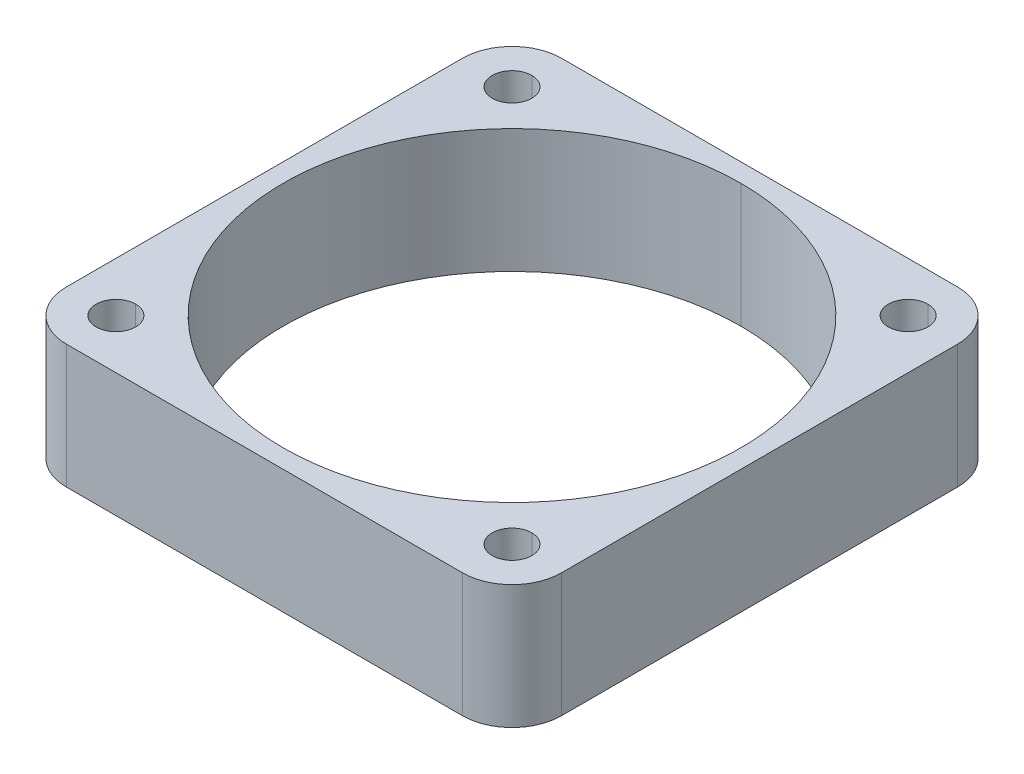
ISO-10303-21;
HEADER;
FILE_DESCRIPTION(('STEP AP214'),'2;1');
FILE_NAME('part.step','',(''),(''),'','','');
FILE_SCHEMA(('AUTOMOTIVE_DESIGN { 1 0 10303 214 1 1 1 1 }'));
ENDSEC;
DATA;
#1=APPLICATION_CONTEXT('core data for automotive mechanical design processes');
#2=APPLICATION_PROTOCOL_DEFINITION('international standard','automotive_design',2000,#1);
#3=PRODUCT_CONTEXT('',#1,'mechanical');
#4=PRODUCT('Part','Part','',(#3));
#5=PRODUCT_RELATED_PRODUCT_CATEGORY('part','',(#4));
#6=PRODUCT_DEFINITION_FORMATION('','',#4);
#7=PRODUCT_DEFINITION_CONTEXT('part definition',#1,'design');
#8=PRODUCT_DEFINITION('design','',#6,#7);
#9=PRODUCT_DEFINITION_SHAPE('','',#8);
#10=(LENGTH_UNIT() NAMED_UNIT(*) SI_UNIT(.MILLI.,.METRE.));
#11=(NAMED_UNIT(*) PLANE_ANGLE_UNIT() SI_UNIT($,.RADIAN.));
#12=(NAMED_UNIT(*) SI_UNIT($,.STERADIAN.) SOLID_ANGLE_UNIT());
#13=UNCERTAINTY_MEASURE_WITH_UNIT(LENGTH_MEASURE(1.E-05),#10,'distance_accuracy_value','');
#14=(GEOMETRIC_REPRESENTATION_CONTEXT(3) GLOBAL_UNCERTAINTY_ASSIGNED_CONTEXT((#13)) GLOBAL_UNIT_ASSIGNED_CONTEXT((#10,
#11,#12)) REPRESENTATION_CONTEXT('',''));
#15=CARTESIAN_POINT('',(0.,0.,0.));
#16=DIRECTION('',(0.,0.,1.));
#17=DIRECTION('',(1.,0.,0.));
#18=AXIS2_PLACEMENT_3D('',#15,#16,#17);
#19=CARTESIAN_POINT('',(16.,5.,16.));
#20=DIRECTION('',(0.,-1.,0.));
#21=DIRECTION('',(0.,0.,-1.));
#22=AXIS2_PLACEMENT_3D('',#19,#20,#21);
#23=CYLINDRICAL_SURFACE('',#22,1.6);
#24=CARTESIAN_POINT('',(16.,5.,16.));
#25=DIRECTION('',(0.,1.,0.));
#26=DIRECTION('',(0.,0.,1.));
#27=AXIS2_PLACEMENT_3D('',#24,#25,#26);
#28=CIRCLE('',#27,1.6);
#29=CARTESIAN_POINT('',(16.,5.,17.6));
#30=VERTEX_POINT('',#29);
#31=CARTESIAN_POINT('',(16.,5.,14.4));
#32=VERTEX_POINT('',#31);
#33=EDGE_CURVE('E268',#30,#32,#28,.T.);
#34=ORIENTED_EDGE('',*,*,#33,.T.);
#35=DIRECTION('',(0.,-1.,0.));
#36=VECTOR('',#35,1.);
#37=CARTESIAN_POINT('',(16.,5.,14.4));
#38=LINE('',#37,#36);
#39=CARTESIAN_POINT('',(16.,-5.,14.4));
#40=VERTEX_POINT('',#39);
#41=EDGE_CURVE('E11',#32,#40,#38,.T.);
#42=ORIENTED_EDGE('',*,*,#41,.T.);
#43=CARTESIAN_POINT('',(16.,-5.,16.));
#44=DIRECTION('',(0.,-1.,0.));
#45=DIRECTION('',(0.,0.,-1.));
#46=AXIS2_PLACEMENT_3D('',#43,#44,#45);
#47=CIRCLE('',#46,1.6);
#48=CARTESIAN_POINT('',(16.,-5.,17.6));
#49=VERTEX_POINT('',#48);
#50=EDGE_CURVE('E207',#40,#49,#47,.T.);
#51=ORIENTED_EDGE('',*,*,#50,.T.);
#52=DIRECTION('',(0.,-1.,0.));
#53=VECTOR('',#52,1.);
#54=CARTESIAN_POINT('',(16.,5.,17.6));
#55=LINE('',#54,#53);
#56=EDGE_CURVE('E27',#30,#49,#55,.T.);
#57=ORIENTED_EDGE('',*,*,#56,.F.);
#58=EDGE_LOOP('',(#34,#42,#51,#57));
#59=FACE_BOUND('',#58,.T.);
#60=ADVANCED_FACE('F16',(#59),#23,.F.);
#61=CARTESIAN_POINT('',(16.,5.,16.));
#62=DIRECTION('',(0.,-1.,0.));
#63=DIRECTION('',(0.,0.,-1.));
#64=AXIS2_PLACEMENT_3D('',#61,#62,#63);
#65=CYLINDRICAL_SURFACE('',#64,1.6);
#66=ORIENTED_EDGE('',*,*,#56,.T.);
#67=CARTESIAN_POINT('',(16.,-5.,16.));
#68=DIRECTION('',(0.,-1.,0.));
#69=DIRECTION('',(0.,0.,1.));
#70=AXIS2_PLACEMENT_3D('',#67,#68,#69);
#71=CIRCLE('',#70,1.6);
#72=EDGE_CURVE('E241',#49,#40,#71,.T.);
#73=ORIENTED_EDGE('',*,*,#72,.T.);
#74=ORIENTED_EDGE('',*,*,#41,.F.);
#75=CARTESIAN_POINT('',(16.,5.,16.));
#76=DIRECTION('',(0.,1.,0.));
#77=DIRECTION('',(0.,0.,-1.));
#78=AXIS2_PLACEMENT_3D('',#75,#76,#77);
#79=CIRCLE('',#78,1.6);
#80=EDGE_CURVE('E228',#32,#30,#79,.T.);
#81=ORIENTED_EDGE('',*,*,#80,.T.);
#82=EDGE_LOOP('',(#66,#73,#74,#81));
#83=FACE_BOUND('',#82,.T.);
#84=ADVANCED_FACE('F432',(#83),#65,.F.);
#85=CARTESIAN_POINT('',(-16.,5.,16.));
#86=DIRECTION('',(0.,-1.,0.));
#87=DIRECTION('',(0.,0.,-1.));
#88=AXIS2_PLACEMENT_3D('',#85,#86,#87);
#89=CYLINDRICAL_SURFACE('',#88,1.6);
#90=CARTESIAN_POINT('',(-16.,5.,16.));
#91=DIRECTION('',(0.,1.,0.));
#92=DIRECTION('',(0.,0.,1.));
#93=AXIS2_PLACEMENT_3D('',#90,#91,#92);
#94=CIRCLE('',#93,1.6);
#95=CARTESIAN_POINT('',(-16.,5.,17.6));
#96=VERTEX_POINT('',#95);
#97=CARTESIAN_POINT('',(-16.,5.,14.4));
#98=VERTEX_POINT('',#97);
#99=EDGE_CURVE('E277',#96,#98,#94,.T.);
#100=ORIENTED_EDGE('',*,*,#99,.T.);
#101=DIRECTION('',(0.,-1.,0.));
#102=VECTOR('',#101,1.);
#103=CARTESIAN_POINT('',(-16.,5.,14.4));
#104=LINE('',#103,#102);
#105=CARTESIAN_POINT('',(-16.,-5.,14.4));
#106=VERTEX_POINT('',#105);
#107=EDGE_CURVE('E200',#98,#106,#104,.T.);
#108=ORIENTED_EDGE('',*,*,#107,.T.);
#109=CARTESIAN_POINT('',(-16.,-5.,16.));
#110=DIRECTION('',(0.,-1.,0.));
#111=DIRECTION('',(0.,0.,-1.));
#112=AXIS2_PLACEMENT_3D('',#109,#110,#111);
#113=CIRCLE('',#112,1.6);
#114=CARTESIAN_POINT('',(-16.,-5.,17.6));
#115=VERTEX_POINT('',#114);
#116=EDGE_CURVE('E20',#106,#115,#113,.T.);
#117=ORIENTED_EDGE('',*,*,#116,.T.);
#118=DIRECTION('',(0.,-1.,0.));
#119=VECTOR('',#118,1.);
#120=CARTESIAN_POINT('',(-16.,5.,17.6));
#121=LINE('',#120,#119);
#122=EDGE_CURVE('E189',#96,#115,#121,.T.);
#123=ORIENTED_EDGE('',*,*,#122,.F.);
#124=EDGE_LOOP('',(#100,#108,#117,#123));
#125=FACE_BOUND('',#124,.T.);
#126=ADVANCED_FACE('F209',(#125),#89,.F.);
#127=CARTESIAN_POINT('',(-16.,5.,16.));
#128=DIRECTION('',(0.,-1.,0.));
#129=DIRECTION('',(0.,0.,-1.));
#130=AXIS2_PLACEMENT_3D('',#127,#128,#129);
#131=CYLINDRICAL_SURFACE('',#130,1.6);
#132=ORIENTED_EDGE('',*,*,#122,.T.);
#133=CARTESIAN_POINT('',(-16.,-5.,16.));
#134=DIRECTION('',(0.,-1.,0.));
#135=DIRECTION('',(0.,0.,1.));
#136=AXIS2_PLACEMENT_3D('',#133,#134,#135);
#137=CIRCLE('',#136,1.6);
#138=EDGE_CURVE('E191',#115,#106,#137,.T.);
#139=ORIENTED_EDGE('',*,*,#138,.T.);
#140=ORIENTED_EDGE('',*,*,#107,.F.);
#141=CARTESIAN_POINT('',(-16.,5.,16.));
#142=DIRECTION('',(0.,1.,0.));
#143=DIRECTION('',(0.,0.,-1.));
#144=AXIS2_PLACEMENT_3D('',#141,#142,#143);
#145=CIRCLE('',#144,1.6);
#146=EDGE_CURVE('E194',#98,#96,#145,.T.);
#147=ORIENTED_EDGE('',*,*,#146,.T.);
#148=EDGE_LOOP('',(#132,#139,#140,#147));
#149=FACE_BOUND('',#148,.T.);
#150=ADVANCED_FACE('F18',(#149),#131,.F.);
#151=CARTESIAN_POINT('',(-16.,5.,-16.));
#152=DIRECTION('',(0.,-1.,0.));
#153=DIRECTION('',(0.,0.,-1.));
#154=AXIS2_PLACEMENT_3D('',#151,#152,#153);
#155=CYLINDRICAL_SURFACE('',#154,1.6);
#156=CARTESIAN_POINT('',(-16.,5.,-16.));
#157=DIRECTION('',(0.,1.,0.));
#158=DIRECTION('',(0.,0.,1.));
#159=AXIS2_PLACEMENT_3D('',#156,#157,#158);
#160=CIRCLE('',#159,1.6);
#161=CARTESIAN_POINT('',(-16.,5.,-14.4));
#162=VERTEX_POINT('',#161);
#163=CARTESIAN_POINT('',(-16.,5.,-17.6));
#164=VERTEX_POINT('',#163);
#165=EDGE_CURVE('E314',#162,#164,#160,.T.);
#166=ORIENTED_EDGE('',*,*,#165,.T.);
#167=DIRECTION('',(0.,-1.,0.));
#168=VECTOR('',#167,1.);
#169=CARTESIAN_POINT('',(-16.,5.,-17.6));
#170=LINE('',#169,#168);
#171=CARTESIAN_POINT('',(-16.,-5.,-17.6));
#172=VERTEX_POINT('',#171);
#173=EDGE_CURVE('E201',#164,#172,#170,.T.);
#174=ORIENTED_EDGE('',*,*,#173,.T.);
#175=CARTESIAN_POINT('',(-16.,-5.,-16.));
#176=DIRECTION('',(0.,-1.,0.));
#177=DIRECTION('',(0.,0.,-1.));
#178=AXIS2_PLACEMENT_3D('',#175,#176,#177);
#179=CIRCLE('',#178,1.6);
#180=CARTESIAN_POINT('',(-16.,-5.,-14.4));
#181=VERTEX_POINT('',#180);
#182=EDGE_CURVE('E217',#172,#181,#179,.T.);
#183=ORIENTED_EDGE('',*,*,#182,.T.);
#184=DIRECTION('',(0.,-1.,0.));
#185=VECTOR('',#184,1.);
#186=CARTESIAN_POINT('',(-16.,5.,-14.4));
#187=LINE('',#186,#185);
#188=EDGE_CURVE('E113',#162,#181,#187,.T.);
#189=ORIENTED_EDGE('',*,*,#188,.F.);
#190=EDGE_LOOP('',(#166,#174,#183,#189));
#191=FACE_BOUND('',#190,.T.);
#192=ADVANCED_FACE('F382',(#191),#155,.F.);
#193=CARTESIAN_POINT('',(-16.,5.,-16.));
#194=DIRECTION('',(0.,-1.,0.));
#195=DIRECTION('',(0.,0.,-1.));
#196=AXIS2_PLACEMENT_3D('',#193,#194,#195);
#197=CYLINDRICAL_SURFACE('',#196,1.6);
#198=ORIENTED_EDGE('',*,*,#188,.T.);
#199=CARTESIAN_POINT('',(-16.,-5.,-16.));
#200=DIRECTION('',(0.,-1.,0.));
#201=DIRECTION('',(0.,0.,1.));
#202=AXIS2_PLACEMENT_3D('',#199,#200,#201);
#203=CIRCLE('',#202,1.6);
#204=EDGE_CURVE('E211',#181,#172,#203,.T.);
#205=ORIENTED_EDGE('',*,*,#204,.T.);
#206=ORIENTED_EDGE('',*,*,#173,.F.);
#207=CARTESIAN_POINT('',(-16.,5.,-16.));
#208=DIRECTION('',(0.,1.,0.));
#209=DIRECTION('',(0.,0.,-1.));
#210=AXIS2_PLACEMENT_3D('',#207,#208,#209);
#211=CIRCLE('',#210,1.6);
#212=EDGE_CURVE('E272',#164,#162,#211,.T.);
#213=ORIENTED_EDGE('',*,*,#212,.T.);
#214=EDGE_LOOP('',(#198,#205,#206,#213));
#215=FACE_BOUND('',#214,.T.);
#216=ADVANCED_FACE('F387',(#215),#197,.F.);
#217=CARTESIAN_POINT('',(16.,5.,-16.));
#218=DIRECTION('',(0.,-1.,0.));
#219=DIRECTION('',(0.,0.,-1.));
#220=AXIS2_PLACEMENT_3D('',#217,#218,#219);
#221=CYLINDRICAL_SURFACE('',#220,1.6);
#222=CARTESIAN_POINT('',(16.,5.,-16.));
#223=DIRECTION('',(0.,1.,0.));
#224=DIRECTION('',(0.,0.,1.));
#225=AXIS2_PLACEMENT_3D('',#222,#223,#224);
#226=CIRCLE('',#225,1.6);
#227=CARTESIAN_POINT('',(16.,5.,-14.4));
#228=VERTEX_POINT('',#227);
#229=CARTESIAN_POINT('',(16.,5.,-17.6));
#230=VERTEX_POINT('',#229);
#231=EDGE_CURVE('E303',#228,#230,#226,.T.);
#232=ORIENTED_EDGE('',*,*,#231,.T.);
#233=DIRECTION('',(0.,-1.,0.));
#234=VECTOR('',#233,1.);
#235=CARTESIAN_POINT('',(16.,5.,-17.6));
#236=LINE('',#235,#234);
#237=CARTESIAN_POINT('',(16.,-5.,-17.6));
#238=VERTEX_POINT('',#237);
#239=EDGE_CURVE('E128',#230,#238,#236,.T.);
#240=ORIENTED_EDGE('',*,*,#239,.T.);
#241=CARTESIAN_POINT('',(16.,-5.,-16.));
#242=DIRECTION('',(0.,-1.,0.));
#243=DIRECTION('',(0.,0.,-1.));
#244=AXIS2_PLACEMENT_3D('',#241,#242,#243);
#245=CIRCLE('',#244,1.6);
#246=CARTESIAN_POINT('',(16.,-5.,-14.4));
#247=VERTEX_POINT('',#246);
#248=EDGE_CURVE('E251',#238,#247,#245,.T.);
#249=ORIENTED_EDGE('',*,*,#248,.T.);
#250=DIRECTION('',(0.,-1.,0.));
#251=VECTOR('',#250,1.);
#252=CARTESIAN_POINT('',(16.,5.,-14.4));
#253=LINE('',#252,#251);
#254=EDGE_CURVE('E244',#228,#247,#253,.T.);
#255=ORIENTED_EDGE('',*,*,#254,.F.);
#256=EDGE_LOOP('',(#232,#240,#249,#255));
#257=FACE_BOUND('',#256,.T.);
#258=ADVANCED_FACE('F460',(#257),#221,.F.);
#259=CARTESIAN_POINT('',(16.,5.,-16.));
#260=DIRECTION('',(0.,-1.,0.));
#261=DIRECTION('',(0.,0.,-1.));
#262=AXIS2_PLACEMENT_3D('',#259,#260,#261);
#263=CYLINDRICAL_SURFACE('',#262,1.6);
#264=ORIENTED_EDGE('',*,*,#254,.T.);
#265=CARTESIAN_POINT('',(16.,-5.,-16.));
#266=DIRECTION('',(0.,-1.,0.));
#267=DIRECTION('',(0.,0.,1.));
#268=AXIS2_PLACEMENT_3D('',#265,#266,#267);
#269=CIRCLE('',#268,1.6);
#270=EDGE_CURVE('E225',#247,#238,#269,.T.);
#271=ORIENTED_EDGE('',*,*,#270,.T.);
#272=ORIENTED_EDGE('',*,*,#239,.F.);
#273=CARTESIAN_POINT('',(16.,5.,-16.));
#274=DIRECTION('',(0.,1.,0.));
#275=DIRECTION('',(0.,0.,-1.));
#276=AXIS2_PLACEMENT_3D('',#273,#274,#275);
#277=CIRCLE('',#276,1.6);
#278=EDGE_CURVE('E306',#230,#228,#277,.T.);
#279=ORIENTED_EDGE('',*,*,#278,.T.);
#280=EDGE_LOOP('',(#264,#271,#272,#279));
#281=FACE_BOUND('',#280,.T.);
#282=ADVANCED_FACE('F465',(#281),#263,.F.);
#283=CARTESIAN_POINT('',(0.,-5.,0.));
#284=DIRECTION('',(0.,1.,0.));
#285=DIRECTION('',(0.,0.,1.));
#286=AXIS2_PLACEMENT_3D('',#283,#284,#285);
#287=CYLINDRICAL_SURFACE('',#286,18.5);
#288=DIRECTION('',(0.,1.,0.));
#289=VECTOR('',#288,1.);
#290=CARTESIAN_POINT('',(0.,-5.,-18.5));
#291=LINE('',#290,#289);
#292=CARTESIAN_POINT('',(0.,-5.,-18.5));
#293=VERTEX_POINT('',#292);
#294=CARTESIAN_POINT('',(0.,5.,-18.5));
#295=VERTEX_POINT('',#294);
#296=EDGE_CURVE('E267',#293,#295,#291,.T.);
#297=ORIENTED_EDGE('',*,*,#296,.T.);
#298=CARTESIAN_POINT('',(0.,5.,0.));
#299=DIRECTION('',(0.,1.,0.));
#300=DIRECTION('',(0.,0.,-1.));
#301=AXIS2_PLACEMENT_3D('',#298,#299,#300);
#302=CIRCLE('',#301,18.5);
#303=CARTESIAN_POINT('',(0.,5.,18.5));
#304=VERTEX_POINT('',#303);
#305=EDGE_CURVE('E292',#295,#304,#302,.T.);
#306=ORIENTED_EDGE('',*,*,#305,.T.);
#307=DIRECTION('',(0.,1.,0.));
#308=VECTOR('',#307,1.);
#309=CARTESIAN_POINT('',(0.,-5.,18.5));
#310=LINE('',#309,#308);
#311=CARTESIAN_POINT('',(0.,-5.,18.5));
#312=VERTEX_POINT('',#311);
#313=EDGE_CURVE('E262',#312,#304,#310,.T.);
#314=ORIENTED_EDGE('',*,*,#313,.F.);
#315=CARTESIAN_POINT('',(0.,-5.,0.));
#316=DIRECTION('',(0.,-1.,0.));
#317=DIRECTION('',(0.,0.,1.));
#318=AXIS2_PLACEMENT_3D('',#315,#316,#317);
#319=CIRCLE('',#318,18.5);
#320=EDGE_CURVE('E354',#312,#293,#319,.T.);
#321=ORIENTED_EDGE('',*,*,#320,.T.);
#322=EDGE_LOOP('',(#297,#306,#314,#321));
#323=FACE_BOUND('',#322,.T.);
#324=ADVANCED_FACE('F472',(#323),#287,.F.);
#325=CARTESIAN_POINT('',(0.,-5.,0.));
#326=DIRECTION('',(0.,1.,0.));
#327=DIRECTION('',(0.,0.,1.));
#328=AXIS2_PLACEMENT_3D('',#325,#326,#327);
#329=CYLINDRICAL_SURFACE('',#328,18.5);
#330=CARTESIAN_POINT('',(0.,-5.,0.));
#331=DIRECTION('',(0.,-1.,0.));
#332=DIRECTION('',(0.,0.,-1.));
#333=AXIS2_PLACEMENT_3D('',#330,#331,#332);
#334=CIRCLE('',#333,18.5);
#335=EDGE_CURVE('E320',#293,#312,#334,.T.);
#336=ORIENTED_EDGE('',*,*,#335,.T.);
#337=ORIENTED_EDGE('',*,*,#313,.T.);
#338=CARTESIAN_POINT('',(0.,5.,0.));
#339=DIRECTION('',(0.,1.,0.));
#340=DIRECTION('',(0.,0.,1.));
#341=AXIS2_PLACEMENT_3D('',#338,#339,#340);
#342=CIRCLE('',#341,18.5);
#343=EDGE_CURVE('E280',#304,#295,#342,.T.);
#344=ORIENTED_EDGE('',*,*,#343,.T.);
#345=ORIENTED_EDGE('',*,*,#296,.F.);
#346=EDGE_LOOP('',(#336,#337,#344,#345));
#347=FACE_BOUND('',#346,.T.);
#348=ADVANCED_FACE('F469',(#347),#329,.F.);
#349=CARTESIAN_POINT('',(16.,5.,-16.));
#350=DIRECTION('',(0.,-1.,0.));
#351=DIRECTION('',(0.,0.,-1.));
#352=AXIS2_PLACEMENT_3D('',#349,#350,#351);
#353=CYLINDRICAL_SURFACE('',#352,4.);
#354=DIRECTION('',(0.,1.,0.));
#355=VECTOR('',#354,1.);
#356=CARTESIAN_POINT('',(20.,-5.,-16.));
#357=LINE('',#356,#355);
#358=CARTESIAN_POINT('',(20.,-5.,-16.));
#359=VERTEX_POINT('',#358);
#360=CARTESIAN_POINT('',(20.,5.,-16.));
#361=VERTEX_POINT('',#360);
#362=EDGE_CURVE('E259',#359,#361,#357,.T.);
#363=ORIENTED_EDGE('',*,*,#362,.F.);
#364=CARTESIAN_POINT('',(16.,-5.,-16.));
#365=DIRECTION('',(0.,1.,0.));
#366=DIRECTION('',(1.,0.,0.));
#367=AXIS2_PLACEMENT_3D('',#364,#365,#366);
#368=CIRCLE('',#367,4.);
#369=CARTESIAN_POINT('',(16.,-5.,-20.));
#370=VERTEX_POINT('',#369);
#371=EDGE_CURVE('E324',#359,#370,#368,.T.);
#372=ORIENTED_EDGE('',*,*,#371,.T.);
#373=DIRECTION('',(0.,-1.,0.));
#374=VECTOR('',#373,1.);
#375=CARTESIAN_POINT('',(16.,5.,-20.));
#376=LINE('',#375,#374);
#377=CARTESIAN_POINT('',(16.,5.,-20.));
#378=VERTEX_POINT('',#377);
#379=EDGE_CURVE('E340',#378,#370,#376,.T.);
#380=ORIENTED_EDGE('',*,*,#379,.F.);
#381=CARTESIAN_POINT('',(16.,5.,-16.));
#382=DIRECTION('',(0.,-1.,0.));
#383=DIRECTION('',(0.,0.,-1.));
#384=AXIS2_PLACEMENT_3D('',#381,#382,#383);
#385=CIRCLE('',#384,4.);
#386=EDGE_CURVE('E293',#378,#361,#385,.T.);
#387=ORIENTED_EDGE('',*,*,#386,.T.);
#388=EDGE_LOOP('',(#363,#372,#380,#387));
#389=FACE_BOUND('',#388,.T.);
#390=ADVANCED_FACE('F418',(#389),#353,.T.);
#391=CARTESIAN_POINT('',(20.,5.,-20.));
#392=DIRECTION('',(-1.,0.,0.));
#393=DIRECTION('',(0.,0.,1.));
#394=AXIS2_PLACEMENT_3D('',#391,#392,#393);
#395=PLANE('',#394);
#396=ORIENTED_EDGE('',*,*,#362,.T.);
#397=DIRECTION('',(0.,0.,-1.));
#398=VECTOR('',#397,1.);
#399=CARTESIAN_POINT('',(20.,5.,16.));
#400=LINE('',#399,#398);
#401=CARTESIAN_POINT('',(20.,5.,16.));
#402=VERTEX_POINT('',#401);
#403=EDGE_CURVE('E331',#402,#361,#400,.T.);
#404=ORIENTED_EDGE('',*,*,#403,.F.);
#405=DIRECTION('',(0.,-1.,0.));
#406=VECTOR('',#405,1.);
#407=CARTESIAN_POINT('',(20.,5.,16.));
#408=LINE('',#407,#406);
#409=CARTESIAN_POINT('',(20.,-5.,16.));
#410=VERTEX_POINT('',#409);
#411=EDGE_CURVE('E263',#402,#410,#408,.T.);
#412=ORIENTED_EDGE('',*,*,#411,.T.);
#413=DIRECTION('',(0.,0.,-1.));
#414=VECTOR('',#413,1.);
#415=CARTESIAN_POINT('',(20.,-5.,16.));
#416=LINE('',#415,#414);
#417=EDGE_CURVE('E327',#410,#359,#416,.T.);
#418=ORIENTED_EDGE('',*,*,#417,.T.);
#419=EDGE_LOOP('',(#396,#404,#412,#418));
#420=FACE_BOUND('',#419,.T.);
#421=ADVANCED_FACE('F456',(#420),#395,.F.);
#422=CARTESIAN_POINT('',(16.,5.,16.));
#423=DIRECTION('',(0.,-1.,0.));
#424=DIRECTION('',(0.,0.,-1.));
#425=AXIS2_PLACEMENT_3D('',#422,#423,#424);
#426=CYLINDRICAL_SURFACE('',#425,4.);
#427=DIRECTION('',(0.,1.,0.));
#428=VECTOR('',#427,1.);
#429=CARTESIAN_POINT('',(16.,-5.,20.));
#430=LINE('',#429,#428);
#431=CARTESIAN_POINT('',(16.,-5.,20.));
#432=VERTEX_POINT('',#431);
#433=CARTESIAN_POINT('',(16.,5.,20.));
#434=VERTEX_POINT('',#433);
#435=EDGE_CURVE('E258',#432,#434,#430,.T.);
#436=ORIENTED_EDGE('',*,*,#435,.F.);
#437=CARTESIAN_POINT('',(16.,-5.,16.));
#438=DIRECTION('',(0.,1.,0.));
#439=DIRECTION('',(0.,0.,1.));
#440=AXIS2_PLACEMENT_3D('',#437,#438,#439);
#441=CIRCLE('',#440,4.);
#442=EDGE_CURVE('E344',#432,#410,#441,.T.);
#443=ORIENTED_EDGE('',*,*,#442,.T.);
#444=ORIENTED_EDGE('',*,*,#411,.F.);
#445=CARTESIAN_POINT('',(16.,5.,16.));
#446=DIRECTION('',(0.,-1.,0.));
#447=DIRECTION('',(1.,0.,0.));
#448=AXIS2_PLACEMENT_3D('',#445,#446,#447);
#449=CIRCLE('',#448,4.);
#450=EDGE_CURVE('E311',#402,#434,#449,.T.);
#451=ORIENTED_EDGE('',*,*,#450,.T.);
#452=EDGE_LOOP('',(#436,#443,#444,#451));
#453=FACE_BOUND('',#452,.T.);
#454=ADVANCED_FACE('F449',(#453),#426,.T.);
#455=CARTESIAN_POINT('',(-20.,5.,20.));
#456=DIRECTION('',(0.,0.,-1.));
#457=DIRECTION('',(0.,-1.,0.));
#458=AXIS2_PLACEMENT_3D('',#455,#456,#457);
#459=PLANE('',#458);
#460=DIRECTION('',(0.,-1.,0.));
#461=VECTOR('',#460,1.);
#462=CARTESIAN_POINT('',(-16.,5.,20.));
#463=LINE('',#462,#461);
#464=CARTESIAN_POINT('',(-16.,5.,20.));
#465=VERTEX_POINT('',#464);
#466=CARTESIAN_POINT('',(-16.,-5.,20.));
#467=VERTEX_POINT('',#466);
#468=EDGE_CURVE('E240',#465,#467,#463,.T.);
#469=ORIENTED_EDGE('',*,*,#468,.T.);
#470=DIRECTION('',(1.,0.,0.));
#471=VECTOR('',#470,1.);
#472=CARTESIAN_POINT('',(-16.,-5.,20.));
#473=LINE('',#472,#471);
#474=EDGE_CURVE('E301',#467,#432,#473,.T.);
#475=ORIENTED_EDGE('',*,*,#474,.T.);
#476=ORIENTED_EDGE('',*,*,#435,.T.);
#477=DIRECTION('',(1.,0.,0.));
#478=VECTOR('',#477,1.);
#479=CARTESIAN_POINT('',(-16.,5.,20.));
#480=LINE('',#479,#478);
#481=EDGE_CURVE('E276',#465,#434,#480,.T.);
#482=ORIENTED_EDGE('',*,*,#481,.F.);
#483=EDGE_LOOP('',(#469,#475,#476,#482));
#484=FACE_BOUND('',#483,.T.);
#485=ADVANCED_FACE('F445',(#484),#459,.F.);
#486=CARTESIAN_POINT('',(-16.,5.,16.));
#487=DIRECTION('',(0.,-1.,0.));
#488=DIRECTION('',(0.,0.,-1.));
#489=AXIS2_PLACEMENT_3D('',#486,#487,#488);
#490=CYLINDRICAL_SURFACE('',#489,4.);
#491=DIRECTION('',(0.,1.,0.));
#492=VECTOR('',#491,1.);
#493=CARTESIAN_POINT('',(-20.,-5.,16.));
#494=LINE('',#493,#492);
#495=CARTESIAN_POINT('',(-20.,-5.,16.));
#496=VERTEX_POINT('',#495);
#497=CARTESIAN_POINT('',(-20.,5.,16.));
#498=VERTEX_POINT('',#497);
#499=EDGE_CURVE('E237',#496,#498,#494,.T.);
#500=ORIENTED_EDGE('',*,*,#499,.F.);
#501=CARTESIAN_POINT('',(-16.,-5.,16.));
#502=DIRECTION('',(0.,1.,0.));
#503=DIRECTION('',(-1.,0.,0.));
#504=AXIS2_PLACEMENT_3D('',#501,#502,#503);
#505=CIRCLE('',#504,4.);
#506=EDGE_CURVE('E297',#496,#467,#505,.T.);
#507=ORIENTED_EDGE('',*,*,#506,.T.);
#508=ORIENTED_EDGE('',*,*,#468,.F.);
#509=CARTESIAN_POINT('',(-16.,5.,16.));
#510=DIRECTION('',(0.,-1.,0.));
#511=DIRECTION('',(0.,0.,1.));
#512=AXIS2_PLACEMENT_3D('',#509,#510,#511);
#513=CIRCLE('',#512,4.);
#514=EDGE_CURVE('E255',#465,#498,#513,.T.);
#515=ORIENTED_EDGE('',*,*,#514,.T.);
#516=EDGE_LOOP('',(#500,#507,#508,#515));
#517=FACE_BOUND('',#516,.T.);
#518=ADVANCED_FACE('F448',(#517),#490,.T.);
#519=CARTESIAN_POINT('',(-20.,5.,-20.));
#520=DIRECTION('',(1.,0.,0.));
#521=DIRECTION('',(0.,1.,0.));
#522=AXIS2_PLACEMENT_3D('',#519,#520,#521);
#523=PLANE('',#522);
#524=DIRECTION('',(0.,-1.,0.));
#525=VECTOR('',#524,1.);
#526=CARTESIAN_POINT('',(-20.,5.,-16.));
#527=LINE('',#526,#525);
#528=CARTESIAN_POINT('',(-20.,5.,-16.));
#529=VERTEX_POINT('',#528);
#530=CARTESIAN_POINT('',(-20.,-5.,-16.));
#531=VERTEX_POINT('',#530);
#532=EDGE_CURVE('E236',#529,#531,#527,.T.);
#533=ORIENTED_EDGE('',*,*,#532,.T.);
#534=DIRECTION('',(0.,0.,1.));
#535=VECTOR('',#534,1.);
#536=CARTESIAN_POINT('',(-20.,-5.,-16.));
#537=LINE('',#536,#535);
#538=EDGE_CURVE('E300',#531,#496,#537,.T.);
#539=ORIENTED_EDGE('',*,*,#538,.T.);
#540=ORIENTED_EDGE('',*,*,#499,.T.);
#541=DIRECTION('',(0.,0.,1.));
#542=VECTOR('',#541,1.);
#543=CARTESIAN_POINT('',(-20.,5.,-16.));
#544=LINE('',#543,#542);
#545=EDGE_CURVE('E235',#529,#498,#544,.T.);
#546=ORIENTED_EDGE('',*,*,#545,.F.);
#547=EDGE_LOOP('',(#533,#539,#540,#546));
#548=FACE_BOUND('',#547,.T.);
#549=ADVANCED_FACE('F391',(#548),#523,.F.);
#550=CARTESIAN_POINT('',(0.,-5.,0.));
#551=DIRECTION('',(0.,1.,0.));
#552=DIRECTION('',(1.,0.,0.));
#553=AXIS2_PLACEMENT_3D('',#550,#551,#552);
#554=PLANE('',#553);
#555=ORIENTED_EDGE('',*,*,#50,.F.);
#556=ORIENTED_EDGE('',*,*,#72,.F.);
#557=EDGE_LOOP('',(#555,#556));
#558=FACE_BOUND('',#557,.T.);
#559=ORIENTED_EDGE('',*,*,#116,.F.);
#560=ORIENTED_EDGE('',*,*,#138,.F.);
#561=EDGE_LOOP('',(#559,#560));
#562=FACE_BOUND('',#561,.T.);
#563=ORIENTED_EDGE('',*,*,#182,.F.);
#564=ORIENTED_EDGE('',*,*,#204,.F.);
#565=EDGE_LOOP('',(#563,#564));
#566=FACE_BOUND('',#565,.T.);
#567=ORIENTED_EDGE('',*,*,#248,.F.);
#568=ORIENTED_EDGE('',*,*,#270,.F.);
#569=EDGE_LOOP('',(#567,#568));
#570=FACE_BOUND('',#569,.T.);
#571=ORIENTED_EDGE('',*,*,#320,.F.);
#572=ORIENTED_EDGE('',*,*,#335,.F.);
#573=EDGE_LOOP('',(#571,#572));
#574=FACE_BOUND('',#573,.T.);
#575=CARTESIAN_POINT('',(-16.,-5.,-16.));
#576=DIRECTION('',(0.,1.,0.));
#577=DIRECTION('',(0.,0.,-1.));
#578=AXIS2_PLACEMENT_3D('',#575,#576,#577);
#579=CIRCLE('',#578,4.);
#580=CARTESIAN_POINT('',(-16.,-5.,-20.));
#581=VERTEX_POINT('',#580);
#582=EDGE_CURVE('E281',#581,#531,#579,.T.);
#583=ORIENTED_EDGE('',*,*,#582,.F.);
#584=DIRECTION('',(-1.,0.,0.));
#585=VECTOR('',#584,1.);
#586=CARTESIAN_POINT('',(16.,-5.,-20.));
#587=LINE('',#586,#585);
#588=EDGE_CURVE('E328',#370,#581,#587,.T.);
#589=ORIENTED_EDGE('',*,*,#588,.F.);
#590=ORIENTED_EDGE('',*,*,#371,.F.);
#591=ORIENTED_EDGE('',*,*,#417,.F.);
#592=ORIENTED_EDGE('',*,*,#442,.F.);
#593=ORIENTED_EDGE('',*,*,#474,.F.);
#594=ORIENTED_EDGE('',*,*,#506,.F.);
#595=ORIENTED_EDGE('',*,*,#538,.F.);
#596=EDGE_LOOP('',(#583,#589,#590,#591,#592,#593,#594,#595));
#597=FACE_BOUND('',#596,.T.);
#598=ADVANCED_FACE('F204',(#558,#562,#566,#570,#574,#597),#554,.F.);
#599=CARTESIAN_POINT('',(-20.,5.,-20.));
#600=DIRECTION('',(0.,0.,1.));
#601=DIRECTION('',(1.,0.,0.));
#602=AXIS2_PLACEMENT_3D('',#599,#600,#601);
#603=PLANE('',#602);
#604=DIRECTION('',(0.,1.,0.));
#605=VECTOR('',#604,1.);
#606=CARTESIAN_POINT('',(-16.,-5.,-20.));
#607=LINE('',#606,#605);
#608=CARTESIAN_POINT('',(-16.,5.,-20.));
#609=VERTEX_POINT('',#608);
#610=EDGE_CURVE('E285',#581,#609,#607,.T.);
#611=ORIENTED_EDGE('',*,*,#610,.T.);
#612=DIRECTION('',(-1.,0.,0.));
#613=VECTOR('',#612,1.);
#614=CARTESIAN_POINT('',(16.,5.,-20.));
#615=LINE('',#614,#613);
#616=EDGE_CURVE('E288',#378,#609,#615,.T.);
#617=ORIENTED_EDGE('',*,*,#616,.F.);
#618=ORIENTED_EDGE('',*,*,#379,.T.);
#619=ORIENTED_EDGE('',*,*,#588,.T.);
#620=EDGE_LOOP('',(#611,#617,#618,#619));
#621=FACE_BOUND('',#620,.T.);
#622=ADVANCED_FACE('F390',(#621),#603,.F.);
#623=CARTESIAN_POINT('',(0.,5.,0.));
#624=DIRECTION('',(0.,1.,0.));
#625=DIRECTION('',(1.,0.,0.));
#626=AXIS2_PLACEMENT_3D('',#623,#624,#625);
#627=PLANE('',#626);
#628=ORIENTED_EDGE('',*,*,#33,.F.);
#629=ORIENTED_EDGE('',*,*,#80,.F.);
#630=EDGE_LOOP('',(#628,#629));
#631=FACE_BOUND('',#630,.T.);
#632=ORIENTED_EDGE('',*,*,#165,.F.);
#633=ORIENTED_EDGE('',*,*,#212,.F.);
#634=EDGE_LOOP('',(#632,#633));
#635=FACE_BOUND('',#634,.T.);
#636=ORIENTED_EDGE('',*,*,#231,.F.);
#637=ORIENTED_EDGE('',*,*,#278,.F.);
#638=EDGE_LOOP('',(#636,#637));
#639=FACE_BOUND('',#638,.T.);
#640=ORIENTED_EDGE('',*,*,#99,.F.);
#641=ORIENTED_EDGE('',*,*,#146,.F.);
#642=EDGE_LOOP('',(#640,#641));
#643=FACE_BOUND('',#642,.T.);
#644=ORIENTED_EDGE('',*,*,#305,.F.);
#645=ORIENTED_EDGE('',*,*,#343,.F.);
#646=EDGE_LOOP('',(#644,#645));
#647=FACE_BOUND('',#646,.T.);
#648=CARTESIAN_POINT('',(-16.,5.,-16.));
#649=DIRECTION('',(0.,-1.,0.));
#650=DIRECTION('',(-1.,0.,0.));
#651=AXIS2_PLACEMENT_3D('',#648,#649,#650);
#652=CIRCLE('',#651,4.);
#653=EDGE_CURVE('E231',#529,#609,#652,.T.);
#654=ORIENTED_EDGE('',*,*,#653,.F.);
#655=ORIENTED_EDGE('',*,*,#545,.T.);
#656=ORIENTED_EDGE('',*,*,#514,.F.);
#657=ORIENTED_EDGE('',*,*,#481,.T.);
#658=ORIENTED_EDGE('',*,*,#450,.F.);
#659=ORIENTED_EDGE('',*,*,#403,.T.);
#660=ORIENTED_EDGE('',*,*,#386,.F.);
#661=ORIENTED_EDGE('',*,*,#616,.T.);
#662=EDGE_LOOP('',(#654,#655,#656,#657,#658,#659,#660,#661));
#663=FACE_BOUND('',#662,.T.);
#664=ADVANCED_FACE('F385',(#631,#635,#639,#643,#647,#663),#627,.T.);
#665=CARTESIAN_POINT('',(-16.,5.,-16.));
#666=DIRECTION('',(0.,-1.,0.));
#667=DIRECTION('',(0.,0.,-1.));
#668=AXIS2_PLACEMENT_3D('',#665,#666,#667);
#669=CYLINDRICAL_SURFACE('',#668,4.);
#670=ORIENTED_EDGE('',*,*,#610,.F.);
#671=ORIENTED_EDGE('',*,*,#582,.T.);
#672=ORIENTED_EDGE('',*,*,#532,.F.);
#673=ORIENTED_EDGE('',*,*,#653,.T.);
#674=EDGE_LOOP('',(#670,#671,#672,#673));
#675=FACE_BOUND('',#674,.T.);
#676=ADVANCED_FACE('F408',(#675),#669,.T.);
#677=CLOSED_SHELL('',(#60,#84,#126,#150,#192,#216,#258,#282,#324,#348,#390,#421,#454,#485,#518,
#549,#598,#622,#664,#676));
#678=MANIFOLD_SOLID_BREP('B1',#677);
#679=ADVANCED_BREP_SHAPE_REPRESENTATION('',(#18,#678),#14);
#680=SHAPE_DEFINITION_REPRESENTATION(#9,#679);
ENDSEC;
END-ISO-10303-21;
